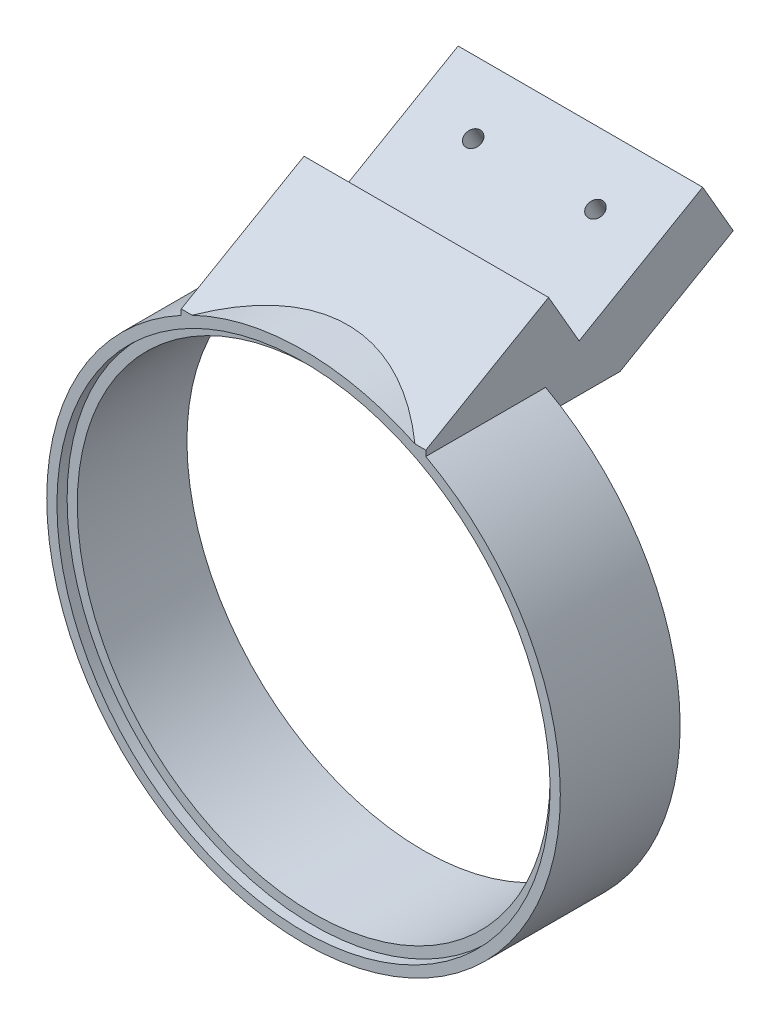
ISO-10303-21;
HEADER;
FILE_DESCRIPTION(('STEP AP214'),'2;1');
FILE_NAME('part.step','',(''),(''),'','','');
FILE_SCHEMA(('AUTOMOTIVE_DESIGN { 1 0 10303 214 1 1 1 1 }'));
ENDSEC;
DATA;
#1=APPLICATION_CONTEXT('core data for automotive mechanical design processes');
#2=APPLICATION_PROTOCOL_DEFINITION('international standard','automotive_design',2000,#1);
#3=PRODUCT_CONTEXT('',#1,'mechanical');
#4=PRODUCT('Part','Part','',(#3));
#5=PRODUCT_RELATED_PRODUCT_CATEGORY('part','',(#4));
#6=PRODUCT_DEFINITION_FORMATION('','',#4);
#7=PRODUCT_DEFINITION_CONTEXT('part definition',#1,'design');
#8=PRODUCT_DEFINITION('design','',#6,#7);
#9=PRODUCT_DEFINITION_SHAPE('','',#8);
#10=(LENGTH_UNIT() NAMED_UNIT(*) SI_UNIT(.MILLI.,.METRE.));
#11=(NAMED_UNIT(*) PLANE_ANGLE_UNIT() SI_UNIT($,.RADIAN.));
#12=(NAMED_UNIT(*) SI_UNIT($,.STERADIAN.) SOLID_ANGLE_UNIT());
#13=UNCERTAINTY_MEASURE_WITH_UNIT(LENGTH_MEASURE(1.E-05),#10,'distance_accuracy_value','');
#14=(GEOMETRIC_REPRESENTATION_CONTEXT(3) GLOBAL_UNCERTAINTY_ASSIGNED_CONTEXT((#13)) GLOBAL_UNIT_ASSIGNED_CONTEXT((#10,
#11,#12)) REPRESENTATION_CONTEXT('',''));
#15=CARTESIAN_POINT('',(0.,0.,0.));
#16=DIRECTION('',(0.,0.,1.));
#17=DIRECTION('',(1.,0.,0.));
#18=AXIS2_PLACEMENT_3D('',#15,#16,#17);
#19=CARTESIAN_POINT('',(-63.001,99.1514793564087,-44.0212701892217));
#20=DIRECTION('',(0.,-0.866025403784439,-0.5));
#21=DIRECTION('',(0.,0.5,-0.866025403784439));
#22=AXIS2_PLACEMENT_3D('',#19,#20,#21);
#23=PLANE('',#22);
#24=DIRECTION('',(0.,0.5,-0.866025403784439));
#25=VECTOR('',#24,1.);
#26=CARTESIAN_POINT('',(30.,99.1514793564087,-44.0212701892217));
#27=LINE('',#26,#25);
#28=CARTESIAN_POINT('',(30.,56.7616892484173,29.4));
#29=VERTEX_POINT('',#28);
#30=CARTESIAN_POINT('',(30.,74.1514793564085,-0.719999999999985));
#31=VERTEX_POINT('',#30);
#32=EDGE_CURVE('E177',#29,#31,#27,.T.);
#33=ORIENTED_EDGE('',*,*,#32,.T.);
#34=DIRECTION('',(1.,0.,0.));
#35=VECTOR('',#34,1.);
#36=CARTESIAN_POINT('',(-30.,74.1514793564085,-0.719999999999985));
#37=LINE('',#36,#35);
#38=CARTESIAN_POINT('',(-30.,74.1514793564085,-0.719999999999985));
#39=VERTEX_POINT('',#38);
#40=EDGE_CURVE('E205',#39,#31,#37,.T.);
#41=ORIENTED_EDGE('',*,*,#40,.F.);
#42=DIRECTION('',(0.,-0.5,0.866025403784439));
#43=VECTOR('',#42,1.);
#44=CARTESIAN_POINT('',(-30.,99.1514793564087,-44.0212701892217));
#45=LINE('',#44,#43);
#46=CARTESIAN_POINT('',(-30.,56.7616892484173,29.4));
#47=VERTEX_POINT('',#46);
#48=EDGE_CURVE('E180',#39,#47,#45,.T.);
#49=ORIENTED_EDGE('',*,*,#48,.T.);
#50=DIRECTION('',(-1.,0.,0.));
#51=VECTOR('',#50,1.);
#52=CARTESIAN_POINT('',(-63.001,56.7616892484173,29.4));
#53=LINE('',#52,#51);
#54=CARTESIAN_POINT('',(-27.3333245995819,56.7616892484173,29.4));
#55=VERTEX_POINT('',#54);
#56=EDGE_CURVE('E191',#55,#47,#53,.T.);
#57=ORIENTED_EDGE('',*,*,#56,.F.);
#58=CARTESIAN_POINT('',(0.,0.,127.714129701695));
#59=DIRECTION('',(0.,0.866025403784439,0.5));
#60=DIRECTION('',(0.,0.5,-0.866025403784439));
#61=AXIS2_PLACEMENT_3D('',#58,#59,#60);
#62=ELLIPSE('',#61,126.,63.);
#63=CARTESIAN_POINT('',(27.3333245995819,56.7616892484173,29.4));
#64=VERTEX_POINT('',#63);
#65=EDGE_CURVE('E182',#64,#55,#62,.T.);
#66=ORIENTED_EDGE('',*,*,#65,.F.);
#67=EDGE_CURVE('E190',#29,#64,#53,.T.);
#68=ORIENTED_EDGE('',*,*,#67,.F.);
#69=EDGE_LOOP('',(#33,#41,#49,#57,#66,#68));
#70=FACE_BOUND('',#69,.T.);
#71=ADVANCED_FACE('F40',(#70),#23,.F.);
#72=CARTESIAN_POINT('',(30.,55.3985559378582,29.4));
#73=DIRECTION('',(1.,0.,0.));
#74=DIRECTION('',(0.,0.,-1.));
#75=AXIS2_PLACEMENT_3D('',#72,#73,#74);
#76=PLANE('',#75);
#77=DIRECTION('',(0.,0.866025403784436,0.500000000000004));
#78=VECTOR('',#77,1.);
#79=CARTESIAN_POINT('',(30.,-36.4585037019825,-104.995222337097));
#80=LINE('',#79,#78);
#81=CARTESIAN_POINT('',(30.,65.6707172428757,-46.0308891324554));
#82=VERTEX_POINT('',#81);
#83=CARTESIAN_POINT('',(30.,78.6610982996422,-38.5308891324553));
#84=VERTEX_POINT('',#83);
#85=EDGE_CURVE('E121',#82,#84,#80,.T.);
#86=ORIENTED_EDGE('',*,*,#85,.T.);
#87=DIRECTION('',(0.,0.500000000000004,-0.866025403784436));
#88=VECTOR('',#87,1.);
#89=CARTESIAN_POINT('',(30.,61.161098299642,-8.22000000000005));
#90=LINE('',#89,#88);
#91=CARTESIAN_POINT('',(30.,61.161098299642,-8.22000000000005));
#92=VERTEX_POINT('',#91);
#93=EDGE_CURVE('E196',#92,#84,#90,.T.);
#94=ORIENTED_EDGE('',*,*,#93,.F.);
#95=DIRECTION('',(0.,-0.866025403784436,-0.500000000000005));
#96=VECTOR('',#95,1.);
#97=CARTESIAN_POINT('',(30.,74.1514793564085,-0.719999999999985));
#98=LINE('',#97,#96);
#99=EDGE_CURVE('E203',#31,#92,#98,.T.);
#100=ORIENTED_EDGE('',*,*,#99,.F.);
#101=ORIENTED_EDGE('',*,*,#32,.F.);
#102=DIRECTION('',(0.,-1.,0.));
#103=VECTOR('',#102,1.);
#104=CARTESIAN_POINT('',(30.,55.3985559378582,29.4));
#105=LINE('',#104,#103);
#106=CARTESIAN_POINT('',(30.,55.3985559378582,29.4));
#107=VERTEX_POINT('',#106);
#108=EDGE_CURVE('E188',#29,#107,#105,.T.);
#109=ORIENTED_EDGE('',*,*,#108,.T.);
#110=DIRECTION('',(0.,0.,-1.));
#111=VECTOR('',#110,1.);
#112=CARTESIAN_POINT('',(30.,55.3985559378582,29.4));
#113=LINE('',#112,#111);
#114=CARTESIAN_POINT('',(30.,55.3985559378582,0.));
#115=VERTEX_POINT('',#114);
#116=EDGE_CURVE('E65',#107,#115,#113,.T.);
#117=ORIENTED_EDGE('',*,*,#116,.T.);
#118=DIRECTION('',(0.,-1.,0.));
#119=VECTOR('',#118,1.);
#120=CARTESIAN_POINT('',(30.,0.,0.));
#121=LINE('',#120,#119);
#122=CARTESIAN_POINT('',(30.,49.6386945839634,0.));
#123=VERTEX_POINT('',#122);
#124=EDGE_CURVE('E145',#115,#123,#121,.T.);
#125=ORIENTED_EDGE('',*,*,#124,.T.);
#126=DIRECTION('',(0.,0.,1.));
#127=VECTOR('',#126,1.);
#128=CARTESIAN_POINT('',(30.,49.6386945839634,-59.021270189222));
#129=LINE('',#128,#127);
#130=CARTESIAN_POINT('',(30.,49.6386945839634,-18.2626113391243));
#131=VERTEX_POINT('',#130);
#132=EDGE_CURVE('E173',#131,#123,#129,.T.);
#133=ORIENTED_EDGE('',*,*,#132,.F.);
#134=DIRECTION('',(0.,-0.500000000000004,0.866025403784436));
#135=VECTOR('',#134,1.);
#136=CARTESIAN_POINT('',(30.,73.1707172428757,-59.021270189222));
#137=LINE('',#136,#135);
#138=EDGE_CURVE('E141',#82,#131,#137,.T.);
#139=ORIENTED_EDGE('',*,*,#138,.F.);
#140=EDGE_LOOP('',(#86,#94,#100,#101,#109,#117,#125,#133,#139));
#141=FACE_BOUND('',#140,.T.);
#142=ADVANCED_FACE('F223',(#141),#76,.T.);
#143=CARTESIAN_POINT('',(-30.,55.3985559378582,29.4));
#144=DIRECTION('',(1.,0.,0.));
#145=DIRECTION('',(0.,0.,-1.));
#146=AXIS2_PLACEMENT_3D('',#143,#144,#145);
#147=PLANE('',#146);
#148=DIRECTION('',(0.,0.500000000000004,-0.866025403784436));
#149=VECTOR('',#148,1.);
#150=CARTESIAN_POINT('',(-30.,61.161098299642,-8.22000000000005));
#151=LINE('',#150,#149);
#152=CARTESIAN_POINT('',(-30.,61.161098299642,-8.22000000000005));
#153=VERTEX_POINT('',#152);
#154=CARTESIAN_POINT('',(-30.,78.6610982996422,-38.5308891324553));
#155=VERTEX_POINT('',#154);
#156=EDGE_CURVE('E133',#153,#155,#151,.T.);
#157=ORIENTED_EDGE('',*,*,#156,.T.);
#158=DIRECTION('',(0.,0.866025403784436,0.500000000000004));
#159=VECTOR('',#158,1.);
#160=CARTESIAN_POINT('',(-30.,-36.4585037019825,-104.995222337097));
#161=LINE('',#160,#159);
#162=CARTESIAN_POINT('',(-30.,65.6707172428756,-46.0308891324554));
#163=VERTEX_POINT('',#162);
#164=EDGE_CURVE('E57',#163,#155,#161,.T.);
#165=ORIENTED_EDGE('',*,*,#164,.F.);
#166=DIRECTION('',(0.,0.500000000000004,-0.866025403784436));
#167=VECTOR('',#166,1.);
#168=CARTESIAN_POINT('',(-30.,48.1707172428755,-15.7200000000001));
#169=LINE('',#168,#167);
#170=CARTESIAN_POINT('',(-30.,49.6386945839634,-18.2626113391243));
#171=VERTEX_POINT('',#170);
#172=EDGE_CURVE('E131',#171,#163,#169,.T.);
#173=ORIENTED_EDGE('',*,*,#172,.F.);
#174=DIRECTION('',(0.,0.,1.));
#175=VECTOR('',#174,1.);
#176=CARTESIAN_POINT('',(-30.,49.6386945839634,-59.021270189222));
#177=LINE('',#176,#175);
#178=CARTESIAN_POINT('',(-30.,49.6386945839634,0.));
#179=VERTEX_POINT('',#178);
#180=EDGE_CURVE('E175',#171,#179,#177,.T.);
#181=ORIENTED_EDGE('',*,*,#180,.T.);
#182=DIRECTION('',(0.,1.,0.));
#183=VECTOR('',#182,1.);
#184=CARTESIAN_POINT('',(-30.,0.,0.));
#185=LINE('',#184,#183);
#186=CARTESIAN_POINT('',(-30.,55.3985559378582,0.));
#187=VERTEX_POINT('',#186);
#188=EDGE_CURVE('E167',#179,#187,#185,.T.);
#189=ORIENTED_EDGE('',*,*,#188,.T.);
#190=DIRECTION('',(0.,0.,-1.));
#191=VECTOR('',#190,1.);
#192=CARTESIAN_POINT('',(-30.,55.3985559378582,29.4));
#193=LINE('',#192,#191);
#194=CARTESIAN_POINT('',(-30.,55.3985559378582,29.4));
#195=VERTEX_POINT('',#194);
#196=EDGE_CURVE('E143',#195,#187,#193,.T.);
#197=ORIENTED_EDGE('',*,*,#196,.F.);
#198=DIRECTION('',(0.,-1.,0.));
#199=VECTOR('',#198,1.);
#200=CARTESIAN_POINT('',(-30.,55.3985559378582,29.4));
#201=LINE('',#200,#199);
#202=EDGE_CURVE('E194',#47,#195,#201,.T.);
#203=ORIENTED_EDGE('',*,*,#202,.F.);
#204=ORIENTED_EDGE('',*,*,#48,.F.);
#205=DIRECTION('',(0.,0.866025403784436,0.500000000000005));
#206=VECTOR('',#205,1.);
#207=CARTESIAN_POINT('',(-30.,74.1514793564085,-0.719999999999985));
#208=LINE('',#207,#206);
#209=EDGE_CURVE('E207',#153,#39,#208,.T.);
#210=ORIENTED_EDGE('',*,*,#209,.F.);
#211=EDGE_LOOP('',(#157,#165,#173,#181,#189,#197,#203,#204,#210));
#212=FACE_BOUND('',#211,.T.);
#213=ADVANCED_FACE('F130',(#212),#147,.F.);
#214=CARTESIAN_POINT('',(0.,0.,27.4));
#215=DIRECTION('',(0.,0.,1.));
#216=DIRECTION('',(1.,0.,0.));
#217=AXIS2_PLACEMENT_3D('',#214,#215,#216);
#218=CYLINDRICAL_SURFACE('',#217,60.5);
#219=CARTESIAN_POINT('',(0.,0.,26.9));
#220=DIRECTION('',(0.,0.,1.));
#221=DIRECTION('',(1.,0.,0.));
#222=AXIS2_PLACEMENT_3D('',#219,#220,#221);
#223=CIRCLE('',#222,60.5);
#224=CARTESIAN_POINT('',(60.5,0.,26.9));
#225=VERTEX_POINT('',#224);
#226=EDGE_CURVE('E185',#225,#225,#223,.T.);
#227=ORIENTED_EDGE('',*,*,#226,.F.);
#228=EDGE_LOOP('',(#227));
#229=FACE_BOUND('',#228,.T.);
#230=CARTESIAN_POINT('',(0.,0.,29.4));
#231=DIRECTION('',(0.,0.,1.));
#232=DIRECTION('',(1.,0.,0.));
#233=AXIS2_PLACEMENT_3D('',#230,#231,#232);
#234=CIRCLE('',#233,60.5);
#235=CARTESIAN_POINT('',(60.5,0.,29.4));
#236=VERTEX_POINT('',#235);
#237=EDGE_CURVE('E149',#236,#236,#234,.T.);
#238=ORIENTED_EDGE('',*,*,#237,.T.);
#239=EDGE_LOOP('',(#238));
#240=FACE_BOUND('',#239,.T.);
#241=ADVANCED_FACE('F262',(#229,#240),#218,.F.);
#242=CARTESIAN_POINT('',(0.,0.,29.4));
#243=DIRECTION('',(0.,0.,-1.));
#244=DIRECTION('',(-1.,0.,0.));
#245=AXIS2_PLACEMENT_3D('',#242,#243,#244);
#246=CYLINDRICAL_SURFACE('',#245,58.);
#247=ORIENTED_EDGE('',*,*,#132,.T.);
#248=CARTESIAN_POINT('',(0.,0.,0.));
#249=DIRECTION('',(0.,0.,1.));
#250=DIRECTION('',(1.,0.,0.));
#251=AXIS2_PLACEMENT_3D('',#248,#249,#250);
#252=CIRCLE('',#251,58.);
#253=EDGE_CURVE('E153',#179,#123,#252,.T.);
#254=ORIENTED_EDGE('',*,*,#253,.F.);
#255=ORIENTED_EDGE('',*,*,#180,.F.);
#256=CARTESIAN_POINT('',(0.,0.,67.7141297016935));
#257=DIRECTION('',(0.,-0.866025403784436,-0.500000000000004));
#258=DIRECTION('',(0.,-0.500000000000004,0.866025403784436));
#259=AXIS2_PLACEMENT_3D('',#256,#257,#258);
#260=ELLIPSE('',#259,115.999999999999,58.);
#261=EDGE_CURVE('E140',#171,#131,#260,.T.);
#262=ORIENTED_EDGE('',*,*,#261,.T.);
#263=EDGE_LOOP('',(#247,#254,#255,#262));
#264=FACE_BOUND('',#263,.T.);
#265=CARTESIAN_POINT('',(0.,0.,26.9));
#266=DIRECTION('',(0.,0.,1.));
#267=DIRECTION('',(1.,0.,0.));
#268=AXIS2_PLACEMENT_3D('',#265,#266,#267);
#269=CIRCLE('',#268,58.);
#270=CARTESIAN_POINT('',(58.,0.,26.9));
#271=VERTEX_POINT('',#270);
#272=EDGE_CURVE('E44',#271,#271,#269,.T.);
#273=ORIENTED_EDGE('',*,*,#272,.T.);
#274=EDGE_LOOP('',(#273));
#275=FACE_BOUND('',#274,.T.);
#276=ADVANCED_FACE('F250',(#264,#275),#246,.F.);
#277=CARTESIAN_POINT('',(0.,0.,29.4));
#278=DIRECTION('',(0.,0.,-1.));
#279=DIRECTION('',(-1.,0.,0.));
#280=AXIS2_PLACEMENT_3D('',#277,#278,#279);
#281=CYLINDRICAL_SURFACE('',#280,63.);
#282=ORIENTED_EDGE('',*,*,#116,.F.);
#283=CARTESIAN_POINT('',(0.,0.,29.4));
#284=DIRECTION('',(0.,0.,1.));
#285=DIRECTION('',(1.,0.,0.));
#286=AXIS2_PLACEMENT_3D('',#283,#284,#285);
#287=CIRCLE('',#286,63.);
#288=EDGE_CURVE('E49',#195,#107,#287,.T.);
#289=ORIENTED_EDGE('',*,*,#288,.F.);
#290=ORIENTED_EDGE('',*,*,#196,.T.);
#291=CARTESIAN_POINT('',(0.,0.,0.));
#292=DIRECTION('',(0.,0.,1.));
#293=DIRECTION('',(1.,0.,0.));
#294=AXIS2_PLACEMENT_3D('',#291,#292,#293);
#295=CIRCLE('',#294,63.);
#296=EDGE_CURVE('E155',#187,#115,#295,.T.);
#297=ORIENTED_EDGE('',*,*,#296,.T.);
#298=EDGE_LOOP('',(#282,#289,#290,#297));
#299=FACE_BOUND('',#298,.T.);
#300=ADVANCED_FACE('F160',(#299),#281,.T.);
#301=CARTESIAN_POINT('',(0.,0.,0.));
#302=DIRECTION('',(0.,0.,1.));
#303=DIRECTION('',(1.,0.,0.));
#304=AXIS2_PLACEMENT_3D('',#301,#302,#303);
#305=PLANE('',#304);
#306=ORIENTED_EDGE('',*,*,#124,.F.);
#307=ORIENTED_EDGE('',*,*,#296,.F.);
#308=ORIENTED_EDGE('',*,*,#188,.F.);
#309=ORIENTED_EDGE('',*,*,#253,.T.);
#310=EDGE_LOOP('',(#306,#307,#308,#309));
#311=FACE_BOUND('',#310,.T.);
#312=ADVANCED_FACE('F166',(#311),#305,.F.);
#313=CARTESIAN_POINT('',(0.,29.3210782584106,16.9285324254237));
#314=DIRECTION('',(0.,-0.866025403784436,-0.500000000000004));
#315=DIRECTION('',(0.,0.500000000000004,-0.866025403784436));
#316=AXIS2_PLACEMENT_3D('',#313,#314,#315);
#317=PLANE('',#316);
#318=DIRECTION('',(1.,0.,0.));
#319=VECTOR('',#318,1.);
#320=CARTESIAN_POINT('',(-30.,65.6707172428756,-46.0308891324554));
#321=LINE('',#320,#319);
#322=EDGE_CURVE('E118',#163,#82,#321,.T.);
#323=ORIENTED_EDGE('',*,*,#322,.T.);
#324=ORIENTED_EDGE('',*,*,#138,.T.);
#325=ORIENTED_EDGE('',*,*,#261,.F.);
#326=ORIENTED_EDGE('',*,*,#172,.T.);
#327=EDGE_LOOP('',(#323,#324,#325,#326));
#328=FACE_BOUND('',#327,.T.);
#329=CARTESIAN_POINT('',(-14.9999999999999,59.1395280956812,-34.7185376956724));
#330=DIRECTION('',(0.,-0.866025403784436,-0.500000000000004));
#331=DIRECTION('',(0.,0.500000000000004,-0.866025403784436));
#332=AXIS2_PLACEMENT_3D('',#329,#330,#331);
#333=CIRCLE('',#332,2.);
#334=CARTESIAN_POINT('',(-14.9999999999999,60.1395280956813,-36.4505885032413));
#335=VERTEX_POINT('',#334);
#336=EDGE_CURVE('E213',#335,#335,#333,.T.);
#337=ORIENTED_EDGE('',*,*,#336,.F.);
#338=EDGE_LOOP('',(#337));
#339=FACE_BOUND('',#338,.T.);
#340=CARTESIAN_POINT('',(15.,59.1395280956813,-34.7185376956724));
#341=DIRECTION('',(0.,-0.866025403784436,-0.500000000000004));
#342=DIRECTION('',(0.,0.500000000000004,-0.866025403784436));
#343=AXIS2_PLACEMENT_3D('',#340,#341,#342);
#344=CIRCLE('',#343,2.00000000000001);
#345=CARTESIAN_POINT('',(15.,60.1395280956813,-36.4505885032413));
#346=VERTEX_POINT('',#345);
#347=EDGE_CURVE('E125',#346,#346,#344,.T.);
#348=ORIENTED_EDGE('',*,*,#347,.F.);
#349=EDGE_LOOP('',(#348));
#350=FACE_BOUND('',#349,.T.);
#351=ADVANCED_FACE('F137',(#328,#339,#350),#317,.T.);
#352=EDGE_CURVE('E12',#64,#55,#287,.T.);
#353=ORIENTED_EDGE('',*,*,#352,.F.);
#354=ORIENTED_EDGE('',*,*,#65,.T.);
#355=EDGE_LOOP('',(#353,#354));
#356=FACE_BOUND('',#355,.T.);
#357=ADVANCED_FACE('F42',(#356),#281,.T.);
#358=CARTESIAN_POINT('',(0.,0.,29.4));
#359=DIRECTION('',(0.,0.,1.));
#360=DIRECTION('',(1.,0.,0.));
#361=AXIS2_PLACEMENT_3D('',#358,#359,#360);
#362=PLANE('',#361);
#363=ORIENTED_EDGE('',*,*,#288,.T.);
#364=ORIENTED_EDGE('',*,*,#108,.F.);
#365=ORIENTED_EDGE('',*,*,#67,.T.);
#366=ORIENTED_EDGE('',*,*,#352,.T.);
#367=ORIENTED_EDGE('',*,*,#56,.T.);
#368=ORIENTED_EDGE('',*,*,#202,.T.);
#369=EDGE_LOOP('',(#363,#364,#365,#366,#367,#368));
#370=FACE_BOUND('',#369,.T.);
#371=ORIENTED_EDGE('',*,*,#237,.F.);
#372=EDGE_LOOP('',(#371));
#373=FACE_BOUND('',#372,.T.);
#374=ADVANCED_FACE('F235',(#370,#373),#362,.T.);
#375=CARTESIAN_POINT('',(0.,0.,26.9));
#376=DIRECTION('',(0.,0.,1.));
#377=DIRECTION('',(1.,0.,0.));
#378=AXIS2_PLACEMENT_3D('',#375,#376,#377);
#379=PLANE('',#378);
#380=ORIENTED_EDGE('',*,*,#272,.F.);
#381=EDGE_LOOP('',(#380));
#382=FACE_BOUND('',#381,.T.);
#383=ORIENTED_EDGE('',*,*,#226,.T.);
#384=EDGE_LOOP('',(#383));
#385=FACE_BOUND('',#384,.T.);
#386=ADVANCED_FACE('F246',(#382,#385),#379,.T.);
#387=CARTESIAN_POINT('',(-30.,61.161098299642,-8.22000000000005));
#388=DIRECTION('',(0.,-0.866025403784436,-0.500000000000004));
#389=DIRECTION('',(0.,0.500000000000004,-0.866025403784436));
#390=AXIS2_PLACEMENT_3D('',#387,#388,#389);
#391=PLANE('',#390);
#392=CARTESIAN_POINT('',(-14.9999999999999,72.1299091524478,-27.2185376956723));
#393=DIRECTION('',(0.,-0.866025403784436,-0.500000000000004));
#394=DIRECTION('',(0.,0.500000000000004,-0.866025403784436));
#395=AXIS2_PLACEMENT_3D('',#392,#393,#394);
#396=CIRCLE('',#395,2.);
#397=CARTESIAN_POINT('',(-14.9999999999999,73.1299091524478,-28.9505885032412));
#398=VERTEX_POINT('',#397);
#399=EDGE_CURVE('E209',#398,#398,#396,.F.);
#400=ORIENTED_EDGE('',*,*,#399,.F.);
#401=EDGE_LOOP('',(#400));
#402=FACE_BOUND('',#401,.T.);
#403=CARTESIAN_POINT('',(15.,72.1299091524478,-27.2185376956724));
#404=DIRECTION('',(0.,-0.866025403784436,-0.500000000000004));
#405=DIRECTION('',(0.,0.500000000000004,-0.866025403784436));
#406=AXIS2_PLACEMENT_3D('',#403,#404,#405);
#407=CIRCLE('',#406,2.00000000000001);
#408=CARTESIAN_POINT('',(15.,73.1299091524478,-28.9505885032412));
#409=VERTEX_POINT('',#408);
#410=EDGE_CURVE('E210',#409,#409,#407,.F.);
#411=ORIENTED_EDGE('',*,*,#410,.F.);
#412=EDGE_LOOP('',(#411));
#413=FACE_BOUND('',#412,.T.);
#414=ORIENTED_EDGE('',*,*,#93,.T.);
#415=DIRECTION('',(1.,0.,0.));
#416=VECTOR('',#415,1.);
#417=CARTESIAN_POINT('',(-30.,78.6610982996422,-38.5308891324553));
#418=LINE('',#417,#416);
#419=EDGE_CURVE('E134',#155,#84,#418,.T.);
#420=ORIENTED_EDGE('',*,*,#419,.F.);
#421=ORIENTED_EDGE('',*,*,#156,.F.);
#422=DIRECTION('',(-1.,0.,0.));
#423=VECTOR('',#422,1.);
#424=CARTESIAN_POINT('',(-30.,61.161098299642,-8.22000000000005));
#425=LINE('',#424,#423);
#426=EDGE_CURVE('E199',#92,#153,#425,.T.);
#427=ORIENTED_EDGE('',*,*,#426,.F.);
#428=EDGE_LOOP('',(#414,#420,#421,#427));
#429=FACE_BOUND('',#428,.T.);
#430=ADVANCED_FACE('F226',(#402,#413,#429),#391,.F.);
#431=CARTESIAN_POINT('',(0.,18.8496389844649,-32.6485324254238));
#432=DIRECTION('',(0.,-0.500000000000005,0.866025403784436));
#433=DIRECTION('',(0.,-0.866025403784436,-0.500000000000005));
#434=AXIS2_PLACEMENT_3D('',#431,#432,#433);
#435=PLANE('',#434);
#436=ORIENTED_EDGE('',*,*,#209,.T.);
#437=ORIENTED_EDGE('',*,*,#40,.T.);
#438=ORIENTED_EDGE('',*,*,#99,.T.);
#439=ORIENTED_EDGE('',*,*,#426,.T.);
#440=EDGE_LOOP('',(#436,#437,#438,#439));
#441=FACE_BOUND('',#440,.T.);
#442=ADVANCED_FACE('F228',(#441),#435,.F.);
#443=CARTESIAN_POINT('',(15.,77.0288886380142,-24.3901105709261));
#444=DIRECTION('',(0.,-0.866025403784436,-0.500000000000004));
#445=DIRECTION('',(0.,0.500000000000004,-0.866025403784436));
#446=AXIS2_PLACEMENT_3D('',#443,#444,#445);
#447=CYLINDRICAL_SURFACE('',#446,2.00000000000001);
#448=ORIENTED_EDGE('',*,*,#410,.T.);
#449=EDGE_LOOP('',(#448));
#450=FACE_BOUND('',#449,.T.);
#451=ORIENTED_EDGE('',*,*,#347,.T.);
#452=EDGE_LOOP('',(#451));
#453=FACE_BOUND('',#452,.T.);
#454=ADVANCED_FACE('F314',(#450,#453),#447,.F.);
#455=CARTESIAN_POINT('',(-14.9999999999999,77.0288886380141,-24.3901105709261));
#456=DIRECTION('',(0.,-0.866025403784436,-0.500000000000004));
#457=DIRECTION('',(0.,0.500000000000004,-0.866025403784436));
#458=AXIS2_PLACEMENT_3D('',#455,#456,#457);
#459=CYLINDRICAL_SURFACE('',#458,2.);
#460=ORIENTED_EDGE('',*,*,#399,.T.);
#461=EDGE_LOOP('',(#460));
#462=FACE_BOUND('',#461,.T.);
#463=ORIENTED_EDGE('',*,*,#336,.T.);
#464=EDGE_LOOP('',(#463));
#465=FACE_BOUND('',#464,.T.);
#466=ADVANCED_FACE('F304',(#462,#465),#459,.F.);
#467=CARTESIAN_POINT('',(-30.,-36.4585037019825,-104.995222337097));
#468=DIRECTION('',(0.,-0.500000000000004,0.866025403784436));
#469=DIRECTION('',(0.,-0.866025403784436,-0.500000000000004));
#470=AXIS2_PLACEMENT_3D('',#467,#468,#469);
#471=PLANE('',#470);
#472=ORIENTED_EDGE('',*,*,#164,.T.);
#473=ORIENTED_EDGE('',*,*,#419,.T.);
#474=ORIENTED_EDGE('',*,*,#85,.F.);
#475=ORIENTED_EDGE('',*,*,#322,.F.);
#476=EDGE_LOOP('',(#472,#473,#474,#475));
#477=FACE_BOUND('',#476,.T.);
#478=ADVANCED_FACE('F119',(#477),#471,.F.);
#479=CLOSED_SHELL('',(#71,#142,#213,#241,#276,#300,#312,#351,#357,#374,#386,#430,#442,#454,#466,#478));
#480=MANIFOLD_SOLID_BREP('B2',#479);
#481=ADVANCED_BREP_SHAPE_REPRESENTATION('',(#18,#480),#14);
#482=SHAPE_DEFINITION_REPRESENTATION(#9,#481);
ENDSEC;
END-ISO-10303-21;
